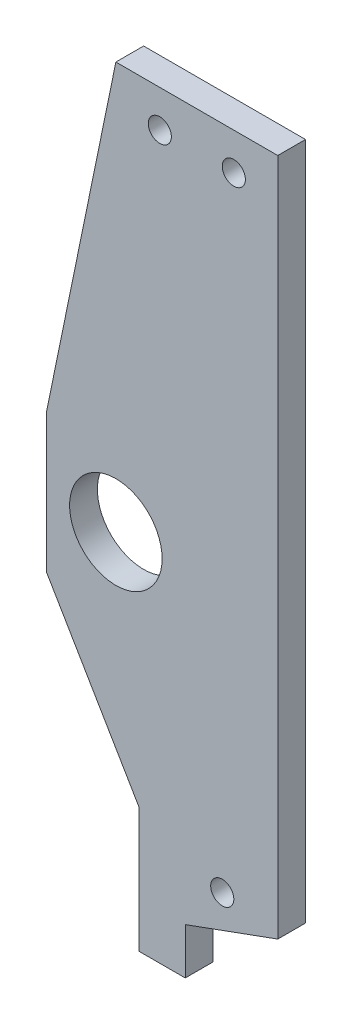
ISO-10303-21;
HEADER;
FILE_DESCRIPTION(('STEP AP214'),'2;1');
FILE_NAME('part.step','',(''),(''),'','','');
FILE_SCHEMA(('AUTOMOTIVE_DESIGN { 1 0 10303 214 1 1 1 1 }'));
ENDSEC;
DATA;
#1=APPLICATION_CONTEXT('core data for automotive mechanical design processes');
#2=APPLICATION_PROTOCOL_DEFINITION('international standard','automotive_design',2000,#1);
#3=PRODUCT_CONTEXT('',#1,'mechanical');
#4=PRODUCT('Part','Part','',(#3));
#5=PRODUCT_RELATED_PRODUCT_CATEGORY('part','',(#4));
#6=PRODUCT_DEFINITION_FORMATION('','',#4);
#7=PRODUCT_DEFINITION_CONTEXT('part definition',#1,'design');
#8=PRODUCT_DEFINITION('design','',#6,#7);
#9=PRODUCT_DEFINITION_SHAPE('','',#8);
#10=(LENGTH_UNIT() NAMED_UNIT(*) SI_UNIT(.MILLI.,.METRE.));
#11=(NAMED_UNIT(*) PLANE_ANGLE_UNIT() SI_UNIT($,.RADIAN.));
#12=(NAMED_UNIT(*) SI_UNIT($,.STERADIAN.) SOLID_ANGLE_UNIT());
#13=UNCERTAINTY_MEASURE_WITH_UNIT(LENGTH_MEASURE(1.E-05),#10,'distance_accuracy_value','');
#14=(GEOMETRIC_REPRESENTATION_CONTEXT(3) GLOBAL_UNCERTAINTY_ASSIGNED_CONTEXT((#13)) GLOBAL_UNIT_ASSIGNED_CONTEXT((#10,
#11,#12)) REPRESENTATION_CONTEXT('',''));
#15=CARTESIAN_POINT('',(0.,0.,0.));
#16=DIRECTION('',(0.,0.,1.));
#17=DIRECTION('',(1.,0.,0.));
#18=AXIS2_PLACEMENT_3D('',#15,#16,#17);
#19=CARTESIAN_POINT('',(-48.1100711776669,-27.9587955259752,0.));
#20=DIRECTION('',(-0.861934215157769,-0.507020126563394,0.));
#21=DIRECTION('',(0.507020126563394,-0.86193421515777,0.));
#22=AXIS2_PLACEMENT_3D('',#19,#20,#21);
#23=PLANE('',#22);
#24=DIRECTION('',(0.507020126563394,-0.861934215157769,0.));
#25=VECTOR('',#24,1.);
#26=CARTESIAN_POINT('',(-48.1100711776669,-27.9587955259752,0.));
#27=LINE('',#26,#25);
#28=CARTESIAN_POINT('',(-48.1100711776669,-27.9587955259752,0.));
#29=VERTEX_POINT('',#28);
#30=CARTESIAN_POINT('',(-38.1100711776668,-44.9587955259753,0.));
#31=VERTEX_POINT('',#30);
#32=EDGE_CURVE('E159',#29,#31,#27,.T.);
#33=ORIENTED_EDGE('',*,*,#32,.T.);
#34=DIRECTION('',(0.,0.,1.));
#35=VECTOR('',#34,1.);
#36=CARTESIAN_POINT('',(-38.1100711776668,-44.9587955259753,0.));
#37=LINE('',#36,#35);
#38=CARTESIAN_POINT('',(-38.1100711776668,-44.9587955259753,3.));
#39=VERTEX_POINT('',#38);
#40=EDGE_CURVE('E128',#31,#39,#37,.T.);
#41=ORIENTED_EDGE('',*,*,#40,.T.);
#42=DIRECTION('',(0.507020126563394,-0.861934215157769,0.));
#43=VECTOR('',#42,1.);
#44=CARTESIAN_POINT('',(-48.1100711776669,-27.9587955259752,3.));
#45=LINE('',#44,#43);
#46=CARTESIAN_POINT('',(-48.1100711776669,-27.9587955259752,3.));
#47=VERTEX_POINT('',#46);
#48=EDGE_CURVE('E143',#47,#39,#45,.T.);
#49=ORIENTED_EDGE('',*,*,#48,.F.);
#50=DIRECTION('',(0.,0.,1.));
#51=VECTOR('',#50,1.);
#52=CARTESIAN_POINT('',(-48.1100711776669,-27.9587955259752,0.));
#53=LINE('',#52,#51);
#54=EDGE_CURVE('E164',#29,#47,#53,.T.);
#55=ORIENTED_EDGE('',*,*,#54,.F.);
#56=EDGE_LOOP('',(#33,#41,#49,#55));
#57=FACE_BOUND('',#56,.T.);
#58=ADVANCED_FACE('F33',(#57),#23,.T.);
#59=CARTESIAN_POINT('',(-23.1100711776669,-53.4587955259752,3.));
#60=DIRECTION('',(-1.,0.,0.));
#61=DIRECTION('',(0.,0.,1.));
#62=AXIS2_PLACEMENT_3D('',#59,#60,#61);
#63=PLANE('',#62);
#64=DIRECTION('',(0.,1.,0.));
#65=VECTOR('',#64,1.);
#66=CARTESIAN_POINT('',(-23.1100711776669,-53.4587955259752,3.));
#67=LINE('',#66,#65);
#68=CARTESIAN_POINT('',(-23.1100711776669,-49.8171420670664,3.));
#69=VERTEX_POINT('',#68);
#70=CARTESIAN_POINT('',(-23.1100711776669,23.5412044740248,3.));
#71=VERTEX_POINT('',#70);
#72=EDGE_CURVE('E59',#69,#71,#67,.T.);
#73=ORIENTED_EDGE('',*,*,#72,.F.);
#74=DIRECTION('',(0.,0.,-1.));
#75=VECTOR('',#74,1.);
#76=CARTESIAN_POINT('',(-23.1100711776669,-49.8171420670664,10.));
#77=LINE('',#76,#75);
#78=CARTESIAN_POINT('',(-23.1100711776669,-49.8171420670664,0.));
#79=VERTEX_POINT('',#78);
#80=EDGE_CURVE('E123',#69,#79,#77,.T.);
#81=ORIENTED_EDGE('',*,*,#80,.T.);
#82=DIRECTION('',(0.,1.,0.));
#83=VECTOR('',#82,1.);
#84=CARTESIAN_POINT('',(-23.1100711776669,-53.4587955259752,0.));
#85=LINE('',#84,#83);
#86=CARTESIAN_POINT('',(-23.1100711776669,23.5412044740248,0.));
#87=VERTEX_POINT('',#86);
#88=EDGE_CURVE('E122',#79,#87,#85,.T.);
#89=ORIENTED_EDGE('',*,*,#88,.T.);
#90=DIRECTION('',(0.,0.,-1.));
#91=VECTOR('',#90,1.);
#92=CARTESIAN_POINT('',(-23.1100711776669,23.5412044740248,3.));
#93=LINE('',#92,#91);
#94=EDGE_CURVE('E42',#71,#87,#93,.T.);
#95=ORIENTED_EDGE('',*,*,#94,.F.);
#96=EDGE_LOOP('',(#73,#81,#89,#95));
#97=FACE_BOUND('',#96,.T.);
#98=ADVANCED_FACE('F35',(#97),#63,.F.);
#99=CARTESIAN_POINT('',(-33.1100711776669,23.5412044740248,3.));
#100=DIRECTION('',(0.,-1.,0.));
#101=DIRECTION('',(0.,0.,-1.));
#102=AXIS2_PLACEMENT_3D('',#99,#100,#101);
#103=PLANE('',#102);
#104=DIRECTION('',(-1.,0.,0.));
#105=VECTOR('',#104,1.);
#106=CARTESIAN_POINT('',(-33.1100711776669,23.5412044740248,0.));
#107=LINE('',#106,#105);
#108=CARTESIAN_POINT('',(-40.6100711776669,23.5412044740248,0.));
#109=VERTEX_POINT('',#108);
#110=EDGE_CURVE('E235',#87,#109,#107,.T.);
#111=ORIENTED_EDGE('',*,*,#110,.T.);
#112=DIRECTION('',(0.,0.,1.));
#113=VECTOR('',#112,1.);
#114=CARTESIAN_POINT('',(-40.6100711776669,23.5412044740248,0.));
#115=LINE('',#114,#113);
#116=CARTESIAN_POINT('',(-40.6100711776669,23.5412044740248,3.));
#117=VERTEX_POINT('',#116);
#118=EDGE_CURVE('E238',#109,#117,#115,.T.);
#119=ORIENTED_EDGE('',*,*,#118,.T.);
#120=DIRECTION('',(-1.,0.,0.));
#121=VECTOR('',#120,1.);
#122=CARTESIAN_POINT('',(-33.1100711776669,23.5412044740248,3.));
#123=LINE('',#122,#121);
#124=EDGE_CURVE('E257',#71,#117,#123,.T.);
#125=ORIENTED_EDGE('',*,*,#124,.F.);
#126=ORIENTED_EDGE('',*,*,#94,.T.);
#127=EDGE_LOOP('',(#111,#119,#125,#126));
#128=FACE_BOUND('',#127,.T.);
#129=ADVANCED_FACE('F217',(#128),#103,.F.);
#130=CARTESIAN_POINT('',(0.,0.,3.));
#131=DIRECTION('',(0.,0.,-1.));
#132=DIRECTION('',(-1.,0.,0.));
#133=AXIS2_PLACEMENT_3D('',#130,#131,#132);
#134=PLANE('',#133);
#135=CARTESIAN_POINT('',(-27.8600711776669,19.5412044740248,3.));
#136=DIRECTION('',(0.,0.,1.));
#137=DIRECTION('',(1.,0.,0.));
#138=AXIS2_PLACEMENT_3D('',#135,#136,#137);
#139=CIRCLE('',#138,1.25);
#140=CARTESIAN_POINT('',(-26.6100711776669,19.5412044740248,3.));
#141=VERTEX_POINT('',#140);
#142=EDGE_CURVE('E191',#141,#141,#139,.T.);
#143=ORIENTED_EDGE('',*,*,#142,.F.);
#144=EDGE_LOOP('',(#143));
#145=FACE_BOUND('',#144,.T.);
#146=CARTESIAN_POINT('',(-29.1100711776668,-48.4587955259752,3.));
#147=DIRECTION('',(0.,0.,1.));
#148=DIRECTION('',(1.,0.,0.));
#149=AXIS2_PLACEMENT_3D('',#146,#147,#148);
#150=CIRCLE('',#149,1.25);
#151=CARTESIAN_POINT('',(-27.8600711776668,-48.4587955259752,3.));
#152=VERTEX_POINT('',#151);
#153=EDGE_CURVE('E185',#152,#152,#150,.T.);
#154=ORIENTED_EDGE('',*,*,#153,.F.);
#155=EDGE_LOOP('',(#154));
#156=FACE_BOUND('',#155,.T.);
#157=CARTESIAN_POINT('',(-40.6100711776669,-20.4587955259752,3.));
#158=DIRECTION('',(0.,0.,1.));
#159=DIRECTION('',(1.,0.,0.));
#160=AXIS2_PLACEMENT_3D('',#157,#158,#159);
#161=CIRCLE('',#160,5.);
#162=CARTESIAN_POINT('',(-35.6100711776669,-20.4587955259752,3.));
#163=VERTEX_POINT('',#162);
#164=EDGE_CURVE('E179',#163,#163,#161,.T.);
#165=ORIENTED_EDGE('',*,*,#164,.F.);
#166=EDGE_LOOP('',(#165));
#167=FACE_BOUND('',#166,.T.);
#168=CARTESIAN_POINT('',(-35.8600711776669,19.5412044740248,3.));
#169=DIRECTION('',(0.,0.,1.));
#170=DIRECTION('',(1.,0.,0.));
#171=AXIS2_PLACEMENT_3D('',#168,#169,#170);
#172=CIRCLE('',#171,1.25);
#173=CARTESIAN_POINT('',(-34.6100711776669,19.5412044740248,3.));
#174=VERTEX_POINT('',#173);
#175=EDGE_CURVE('E172',#174,#174,#172,.T.);
#176=ORIENTED_EDGE('',*,*,#175,.F.);
#177=EDGE_LOOP('',(#176));
#178=FACE_BOUND('',#177,.T.);
#179=DIRECTION('',(0.,1.,0.));
#180=VECTOR('',#179,1.);
#181=CARTESIAN_POINT('',(-33.1100711776669,-53.4587955259752,3.));
#182=LINE('',#181,#180);
#183=CARTESIAN_POINT('',(-33.1100711776669,-58.4587955259752,3.));
#184=VERTEX_POINT('',#183);
#185=CARTESIAN_POINT('',(-33.1100711776669,-53.4587955259752,3.));
#186=VERTEX_POINT('',#185);
#187=EDGE_CURVE('E140',#184,#186,#182,.T.);
#188=ORIENTED_EDGE('',*,*,#187,.T.);
#189=DIRECTION('',(0.939633684604558,0.342182025764742,0.));
#190=VECTOR('',#189,1.);
#191=CARTESIAN_POINT('',(13.3115698835546,-36.5536425520931,3.));
#192=LINE('',#191,#190);
#193=EDGE_CURVE('E109',#186,#69,#192,.T.);
#194=ORIENTED_EDGE('',*,*,#193,.T.);
#195=ORIENTED_EDGE('',*,*,#72,.T.);
#196=ORIENTED_EDGE('',*,*,#124,.T.);
#197=DIRECTION('',(-0.201274298349514,-0.979534918634303,0.));
#198=VECTOR('',#197,1.);
#199=CARTESIAN_POINT('',(-40.6100711776669,23.5412044740248,3.));
#200=LINE('',#199,#198);
#201=CARTESIAN_POINT('',(-48.1100711776669,-12.9587955259752,3.));
#202=VERTEX_POINT('',#201);
#203=EDGE_CURVE('E165',#117,#202,#200,.T.);
#204=ORIENTED_EDGE('',*,*,#203,.T.);
#205=DIRECTION('',(0.,-1.,0.));
#206=VECTOR('',#205,1.);
#207=CARTESIAN_POINT('',(-48.1100711776669,-27.9587955259752,3.));
#208=LINE('',#207,#206);
#209=EDGE_CURVE('E244',#202,#47,#208,.T.);
#210=ORIENTED_EDGE('',*,*,#209,.T.);
#211=ORIENTED_EDGE('',*,*,#48,.T.);
#212=DIRECTION('',(0.,-1.,0.));
#213=VECTOR('',#212,1.);
#214=CARTESIAN_POINT('',(-38.1100711776668,-58.4587955259752,3.));
#215=LINE('',#214,#213);
#216=CARTESIAN_POINT('',(-38.1100711776668,-58.4587955259752,3.));
#217=VERTEX_POINT('',#216);
#218=EDGE_CURVE('E50',#39,#217,#215,.T.);
#219=ORIENTED_EDGE('',*,*,#218,.T.);
#220=DIRECTION('',(1.,0.,0.));
#221=VECTOR('',#220,1.);
#222=CARTESIAN_POINT('',(-33.1100711776669,-58.4587955259752,3.));
#223=LINE('',#222,#221);
#224=EDGE_CURVE('E137',#217,#184,#223,.T.);
#225=ORIENTED_EDGE('',*,*,#224,.T.);
#226=EDGE_LOOP('',(#188,#194,#195,#196,#204,#210,#211,#219,#225));
#227=FACE_BOUND('',#226,.T.);
#228=ADVANCED_FACE('F199',(#145,#156,#167,#178,#227),#134,.F.);
#229=CARTESIAN_POINT('',(0.,0.,0.));
#230=DIRECTION('',(0.,0.,-1.));
#231=DIRECTION('',(-1.,0.,0.));
#232=AXIS2_PLACEMENT_3D('',#229,#230,#231);
#233=PLANE('',#232);
#234=DIRECTION('',(0.939633684604558,0.342182025764742,0.));
#235=VECTOR('',#234,1.);
#236=CARTESIAN_POINT('',(13.3115698835546,-36.5536425520931,0.));
#237=LINE('',#236,#235);
#238=CARTESIAN_POINT('',(-33.1100711776669,-53.4587955259752,0.));
#239=VERTEX_POINT('',#238);
#240=EDGE_CURVE('E107',#239,#79,#237,.T.);
#241=ORIENTED_EDGE('',*,*,#240,.F.);
#242=DIRECTION('',(0.,1.,0.));
#243=VECTOR('',#242,1.);
#244=CARTESIAN_POINT('',(-33.1100711776669,-53.4587955259752,0.));
#245=LINE('',#244,#243);
#246=CARTESIAN_POINT('',(-33.1100711776669,-58.4587955259752,0.));
#247=VERTEX_POINT('',#246);
#248=EDGE_CURVE('E120',#247,#239,#245,.T.);
#249=ORIENTED_EDGE('',*,*,#248,.F.);
#250=DIRECTION('',(1.,0.,0.));
#251=VECTOR('',#250,1.);
#252=CARTESIAN_POINT('',(-33.1100711776669,-58.4587955259752,0.));
#253=LINE('',#252,#251);
#254=CARTESIAN_POINT('',(-38.1100711776668,-58.4587955259752,0.));
#255=VERTEX_POINT('',#254);
#256=EDGE_CURVE('E129',#255,#247,#253,.T.);
#257=ORIENTED_EDGE('',*,*,#256,.F.);
#258=DIRECTION('',(0.,-1.,0.));
#259=VECTOR('',#258,1.);
#260=CARTESIAN_POINT('',(-38.1100711776668,-58.4587955259752,0.));
#261=LINE('',#260,#259);
#262=EDGE_CURVE('E133',#31,#255,#261,.T.);
#263=ORIENTED_EDGE('',*,*,#262,.F.);
#264=ORIENTED_EDGE('',*,*,#32,.F.);
#265=DIRECTION('',(0.,-1.,0.));
#266=VECTOR('',#265,1.);
#267=CARTESIAN_POINT('',(-48.1100711776669,-27.9587955259752,0.));
#268=LINE('',#267,#266);
#269=CARTESIAN_POINT('',(-48.1100711776669,-12.9587955259752,0.));
#270=VERTEX_POINT('',#269);
#271=EDGE_CURVE('E246',#270,#29,#268,.T.);
#272=ORIENTED_EDGE('',*,*,#271,.F.);
#273=DIRECTION('',(-0.201274298349514,-0.979534918634303,0.));
#274=VECTOR('',#273,1.);
#275=CARTESIAN_POINT('',(-40.6100711776669,23.5412044740248,0.));
#276=LINE('',#275,#274);
#277=EDGE_CURVE('E167',#109,#270,#276,.T.);
#278=ORIENTED_EDGE('',*,*,#277,.F.);
#279=ORIENTED_EDGE('',*,*,#110,.F.);
#280=ORIENTED_EDGE('',*,*,#88,.F.);
#281=EDGE_LOOP('',(#241,#249,#257,#263,#264,#272,#278,#279,#280));
#282=FACE_BOUND('',#281,.T.);
#283=CARTESIAN_POINT('',(-27.8600711776669,19.5412044740248,0.));
#284=DIRECTION('',(0.,0.,1.));
#285=DIRECTION('',(1.,0.,0.));
#286=AXIS2_PLACEMENT_3D('',#283,#284,#285);
#287=CIRCLE('',#286,1.25);
#288=CARTESIAN_POINT('',(-26.6100711776669,19.5412044740248,0.));
#289=VERTEX_POINT('',#288);
#290=EDGE_CURVE('E188',#289,#289,#287,.T.);
#291=ORIENTED_EDGE('',*,*,#290,.T.);
#292=EDGE_LOOP('',(#291));
#293=FACE_BOUND('',#292,.T.);
#294=CARTESIAN_POINT('',(-29.1100711776668,-48.4587955259752,0.));
#295=DIRECTION('',(0.,0.,1.));
#296=DIRECTION('',(1.,0.,0.));
#297=AXIS2_PLACEMENT_3D('',#294,#295,#296);
#298=CIRCLE('',#297,1.25);
#299=CARTESIAN_POINT('',(-27.8600711776668,-48.4587955259752,0.));
#300=VERTEX_POINT('',#299);
#301=EDGE_CURVE('E182',#300,#300,#298,.T.);
#302=ORIENTED_EDGE('',*,*,#301,.T.);
#303=EDGE_LOOP('',(#302));
#304=FACE_BOUND('',#303,.T.);
#305=CARTESIAN_POINT('',(-40.6100711776669,-20.4587955259752,0.));
#306=DIRECTION('',(0.,0.,1.));
#307=DIRECTION('',(1.,0.,0.));
#308=AXIS2_PLACEMENT_3D('',#305,#306,#307);
#309=CIRCLE('',#308,5.);
#310=CARTESIAN_POINT('',(-35.6100711776669,-20.4587955259752,0.));
#311=VERTEX_POINT('',#310);
#312=EDGE_CURVE('E177',#311,#311,#309,.T.);
#313=ORIENTED_EDGE('',*,*,#312,.T.);
#314=EDGE_LOOP('',(#313));
#315=FACE_BOUND('',#314,.T.);
#316=CARTESIAN_POINT('',(-35.8600711776669,19.5412044740248,0.));
#317=DIRECTION('',(0.,0.,1.));
#318=DIRECTION('',(1.,0.,0.));
#319=AXIS2_PLACEMENT_3D('',#316,#317,#318);
#320=CIRCLE('',#319,1.25);
#321=CARTESIAN_POINT('',(-34.6100711776669,19.5412044740248,0.));
#322=VERTEX_POINT('',#321);
#323=EDGE_CURVE('E170',#322,#322,#320,.T.);
#324=ORIENTED_EDGE('',*,*,#323,.T.);
#325=EDGE_LOOP('',(#324));
#326=FACE_BOUND('',#325,.T.);
#327=ADVANCED_FACE('F117',(#282,#293,#304,#315,#326),#233,.T.);
#328=CARTESIAN_POINT('',(-48.1100711776669,-27.9587955259752,0.));
#329=DIRECTION('',(-1.,0.,0.));
#330=DIRECTION('',(0.,0.,1.));
#331=AXIS2_PLACEMENT_3D('',#328,#329,#330);
#332=PLANE('',#331);
#333=ORIENTED_EDGE('',*,*,#209,.F.);
#334=DIRECTION('',(0.,0.,1.));
#335=VECTOR('',#334,1.);
#336=CARTESIAN_POINT('',(-48.1100711776669,-12.9587955259752,0.));
#337=LINE('',#336,#335);
#338=EDGE_CURVE('E251',#270,#202,#337,.T.);
#339=ORIENTED_EDGE('',*,*,#338,.F.);
#340=ORIENTED_EDGE('',*,*,#271,.T.);
#341=ORIENTED_EDGE('',*,*,#54,.T.);
#342=EDGE_LOOP('',(#333,#339,#340,#341));
#343=FACE_BOUND('',#342,.T.);
#344=ADVANCED_FACE('F221',(#343),#332,.T.);
#345=CARTESIAN_POINT('',(-40.6100711776669,23.5412044740248,0.));
#346=DIRECTION('',(-0.979534918634303,0.201274298349514,0.));
#347=DIRECTION('',(-0.201274298349514,-0.979534918634303,0.));
#348=AXIS2_PLACEMENT_3D('',#345,#346,#347);
#349=PLANE('',#348);
#350=ORIENTED_EDGE('',*,*,#203,.F.);
#351=ORIENTED_EDGE('',*,*,#118,.F.);
#352=ORIENTED_EDGE('',*,*,#277,.T.);
#353=ORIENTED_EDGE('',*,*,#338,.T.);
#354=EDGE_LOOP('',(#350,#351,#352,#353));
#355=FACE_BOUND('',#354,.T.);
#356=ADVANCED_FACE('F210',(#355),#349,.T.);
#357=CARTESIAN_POINT('',(-33.1100711776669,-53.4587955259752,0.));
#358=DIRECTION('',(1.,0.,0.));
#359=DIRECTION('',(0.,1.,0.));
#360=AXIS2_PLACEMENT_3D('',#357,#358,#359);
#361=PLANE('',#360);
#362=ORIENTED_EDGE('',*,*,#187,.F.);
#363=DIRECTION('',(0.,0.,1.));
#364=VECTOR('',#363,1.);
#365=CARTESIAN_POINT('',(-33.1100711776669,-58.4587955259752,0.));
#366=LINE('',#365,#364);
#367=EDGE_CURVE('E126',#247,#184,#366,.T.);
#368=ORIENTED_EDGE('',*,*,#367,.F.);
#369=ORIENTED_EDGE('',*,*,#248,.T.);
#370=DIRECTION('',(0.,0.,-1.));
#371=VECTOR('',#370,1.);
#372=CARTESIAN_POINT('',(-33.1100711776669,-53.4587955259752,3.));
#373=LINE('',#372,#371);
#374=EDGE_CURVE('E11',#186,#239,#373,.T.);
#375=ORIENTED_EDGE('',*,*,#374,.F.);
#376=EDGE_LOOP('',(#362,#368,#369,#375));
#377=FACE_BOUND('',#376,.T.);
#378=ADVANCED_FACE('F125',(#377),#361,.T.);
#379=CARTESIAN_POINT('',(-33.1100711776669,-58.4587955259752,0.));
#380=DIRECTION('',(0.,-1.,0.));
#381=DIRECTION('',(0.,0.,-1.));
#382=AXIS2_PLACEMENT_3D('',#379,#380,#381);
#383=PLANE('',#382);
#384=ORIENTED_EDGE('',*,*,#224,.F.);
#385=DIRECTION('',(0.,0.,1.));
#386=VECTOR('',#385,1.);
#387=CARTESIAN_POINT('',(-38.1100711776668,-58.4587955259752,0.));
#388=LINE('',#387,#386);
#389=EDGE_CURVE('E131',#255,#217,#388,.T.);
#390=ORIENTED_EDGE('',*,*,#389,.F.);
#391=ORIENTED_EDGE('',*,*,#256,.T.);
#392=ORIENTED_EDGE('',*,*,#367,.T.);
#393=EDGE_LOOP('',(#384,#390,#391,#392));
#394=FACE_BOUND('',#393,.T.);
#395=ADVANCED_FACE('F201',(#394),#383,.T.);
#396=CARTESIAN_POINT('',(-38.1100711776668,-58.4587955259752,0.));
#397=DIRECTION('',(-1.,0.,0.));
#398=DIRECTION('',(0.,0.,1.));
#399=AXIS2_PLACEMENT_3D('',#396,#397,#398);
#400=PLANE('',#399);
#401=ORIENTED_EDGE('',*,*,#218,.F.);
#402=ORIENTED_EDGE('',*,*,#40,.F.);
#403=ORIENTED_EDGE('',*,*,#262,.T.);
#404=ORIENTED_EDGE('',*,*,#389,.T.);
#405=EDGE_LOOP('',(#401,#402,#403,#404));
#406=FACE_BOUND('',#405,.T.);
#407=ADVANCED_FACE('F154',(#406),#400,.T.);
#408=CARTESIAN_POINT('',(-35.8600711776669,19.5412044740248,0.));
#409=DIRECTION('',(0.,0.,1.));
#410=DIRECTION('',(1.,0.,0.));
#411=AXIS2_PLACEMENT_3D('',#408,#409,#410);
#412=CYLINDRICAL_SURFACE('',#411,1.25);
#413=ORIENTED_EDGE('',*,*,#323,.F.);
#414=EDGE_LOOP('',(#413));
#415=FACE_BOUND('',#414,.T.);
#416=ORIENTED_EDGE('',*,*,#175,.T.);
#417=EDGE_LOOP('',(#416));
#418=FACE_BOUND('',#417,.T.);
#419=ADVANCED_FACE('F208',(#415,#418),#412,.F.);
#420=CARTESIAN_POINT('',(-40.6100711776669,-20.4587955259752,0.));
#421=DIRECTION('',(0.,0.,1.));
#422=DIRECTION('',(1.,0.,0.));
#423=AXIS2_PLACEMENT_3D('',#420,#421,#422);
#424=CYLINDRICAL_SURFACE('',#423,5.);
#425=ORIENTED_EDGE('',*,*,#312,.F.);
#426=EDGE_LOOP('',(#425));
#427=FACE_BOUND('',#426,.T.);
#428=ORIENTED_EDGE('',*,*,#164,.T.);
#429=EDGE_LOOP('',(#428));
#430=FACE_BOUND('',#429,.T.);
#431=ADVANCED_FACE('F309',(#427,#430),#424,.F.);
#432=CARTESIAN_POINT('',(-29.1100711776668,-48.4587955259752,0.));
#433=DIRECTION('',(0.,0.,1.));
#434=DIRECTION('',(1.,0.,0.));
#435=AXIS2_PLACEMENT_3D('',#432,#433,#434);
#436=CYLINDRICAL_SURFACE('',#435,1.25);
#437=ORIENTED_EDGE('',*,*,#301,.F.);
#438=EDGE_LOOP('',(#437));
#439=FACE_BOUND('',#438,.T.);
#440=ORIENTED_EDGE('',*,*,#153,.T.);
#441=EDGE_LOOP('',(#440));
#442=FACE_BOUND('',#441,.T.);
#443=ADVANCED_FACE('F302',(#439,#442),#436,.F.);
#444=CARTESIAN_POINT('',(-27.8600711776669,19.5412044740248,0.));
#445=DIRECTION('',(0.,0.,1.));
#446=DIRECTION('',(1.,0.,0.));
#447=AXIS2_PLACEMENT_3D('',#444,#445,#446);
#448=CYLINDRICAL_SURFACE('',#447,1.25);
#449=ORIENTED_EDGE('',*,*,#290,.F.);
#450=EDGE_LOOP('',(#449));
#451=FACE_BOUND('',#450,.T.);
#452=ORIENTED_EDGE('',*,*,#142,.T.);
#453=EDGE_LOOP('',(#452));
#454=FACE_BOUND('',#453,.T.);
#455=ADVANCED_FACE('F292',(#451,#454),#448,.F.);
#456=CARTESIAN_POINT('',(13.3115698835546,-36.5536425520931,10.));
#457=DIRECTION('',(-0.342182025764742,0.939633684604558,0.));
#458=DIRECTION('',(-0.939633684604558,-0.342182025764742,0.));
#459=AXIS2_PLACEMENT_3D('',#456,#457,#458);
#460=PLANE('',#459);
#461=ORIENTED_EDGE('',*,*,#374,.T.);
#462=ORIENTED_EDGE('',*,*,#240,.T.);
#463=ORIENTED_EDGE('',*,*,#80,.F.);
#464=ORIENTED_EDGE('',*,*,#193,.F.);
#465=EDGE_LOOP('',(#461,#462,#463,#464));
#466=FACE_BOUND('',#465,.T.);
#467=ADVANCED_FACE('F106',(#466),#460,.F.);
#468=CLOSED_SHELL('',(#58,#98,#129,#228,#327,#344,#356,#378,#395,#407,#419,#431,#443,#455,#467));
#469=MANIFOLD_SOLID_BREP('B2',#468);
#470=ADVANCED_BREP_SHAPE_REPRESENTATION('',(#18,#469),#14);
#471=SHAPE_DEFINITION_REPRESENTATION(#9,#470);
ENDSEC;
END-ISO-10303-21;
